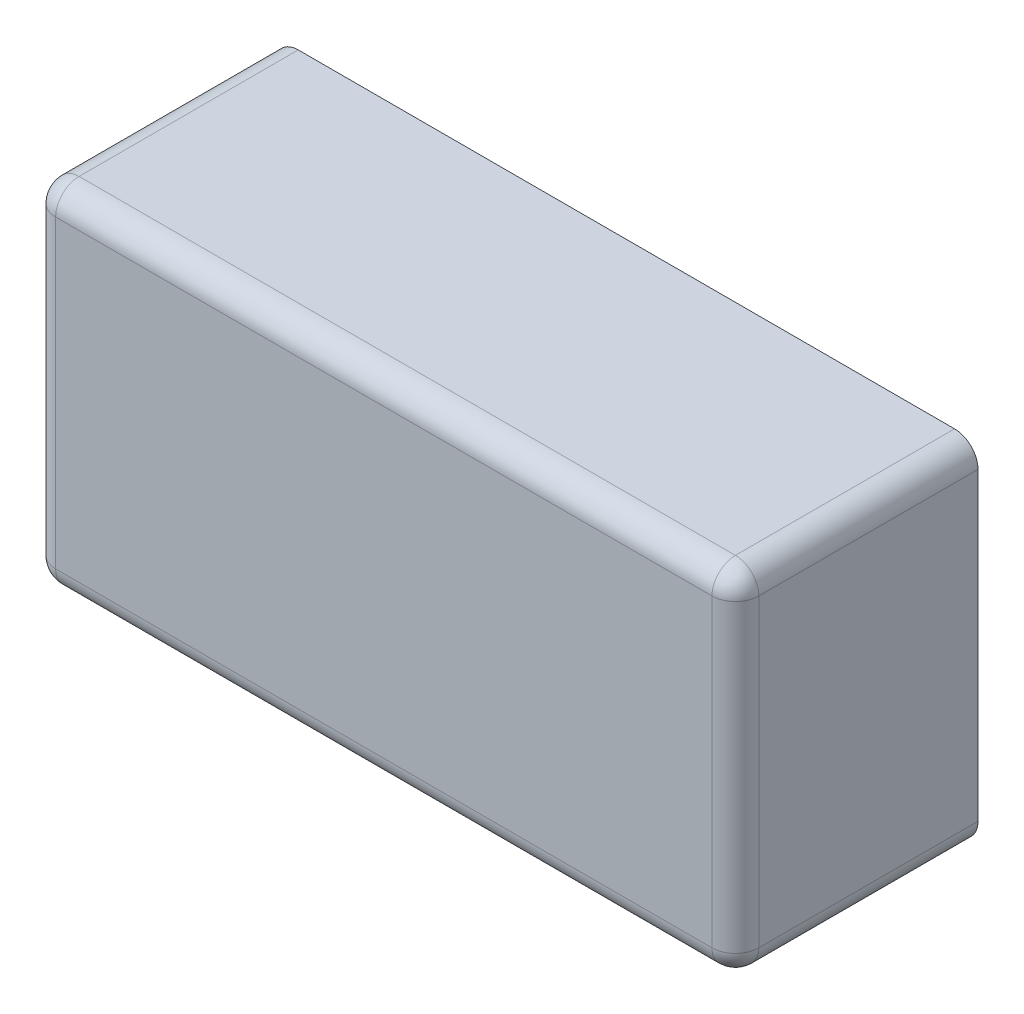
ISO-10303-21;
HEADER;
FILE_DESCRIPTION(('STEP AP214'),'2;1');
FILE_NAME('part.step','',(''),(''),'','','');
FILE_SCHEMA(('AUTOMOTIVE_DESIGN { 1 0 10303 214 1 1 1 1 }'));
ENDSEC;
DATA;
#1=APPLICATION_CONTEXT('core data for automotive mechanical design processes');
#2=APPLICATION_PROTOCOL_DEFINITION('international standard','automotive_design',2000,#1);
#3=PRODUCT_CONTEXT('',#1,'mechanical');
#4=PRODUCT('Part','Part','',(#3));
#5=PRODUCT_RELATED_PRODUCT_CATEGORY('part','',(#4));
#6=PRODUCT_DEFINITION_FORMATION('','',#4);
#7=PRODUCT_DEFINITION_CONTEXT('part definition',#1,'design');
#8=PRODUCT_DEFINITION('design','',#6,#7);
#9=PRODUCT_DEFINITION_SHAPE('','',#8);
#10=(LENGTH_UNIT() NAMED_UNIT(*) SI_UNIT(.MILLI.,.METRE.));
#11=(NAMED_UNIT(*) PLANE_ANGLE_UNIT() SI_UNIT($,.RADIAN.));
#12=(NAMED_UNIT(*) SI_UNIT($,.STERADIAN.) SOLID_ANGLE_UNIT());
#13=UNCERTAINTY_MEASURE_WITH_UNIT(LENGTH_MEASURE(1.E-05),#10,'distance_accuracy_value','');
#14=(GEOMETRIC_REPRESENTATION_CONTEXT(3) GLOBAL_UNCERTAINTY_ASSIGNED_CONTEXT((#13)) GLOBAL_UNIT_ASSIGNED_CONTEXT((#10,
#11,#12)) REPRESENTATION_CONTEXT('',''));
#15=CARTESIAN_POINT('',(0.,0.,0.));
#16=DIRECTION('',(0.,0.,1.));
#17=DIRECTION('',(1.,0.,0.));
#18=AXIS2_PLACEMENT_3D('',#15,#16,#17);
#19=CARTESIAN_POINT('',(0.28,-0.0749999999999999,0.205));
#20=DIRECTION('',(0.,1.,0.));
#21=DIRECTION('',(0.707106781186548,0.,0.707106781186548));
#22=AXIS2_PLACEMENT_3D('',#19,#20,#21);
#23=CYLINDRICAL_SURFACE('',#22,0.02);
#24=CARTESIAN_POINT('',(0.28,-0.13,0.205));
#25=DIRECTION('',(0.,1.,0.));
#26=DIRECTION('',(0.,0.,1.));
#27=AXIS2_PLACEMENT_3D('',#24,#25,#26);
#28=CIRCLE('',#27,0.02);
#29=CARTESIAN_POINT('',(0.28,-0.13,0.225));
#30=VERTEX_POINT('',#29);
#31=CARTESIAN_POINT('',(0.3,-0.13,0.205));
#32=VERTEX_POINT('',#31);
#33=EDGE_CURVE('E11',#30,#32,#28,.T.);
#34=ORIENTED_EDGE('',*,*,#33,.T.);
#35=DIRECTION('',(0.,1.,0.));
#36=VECTOR('',#35,1.);
#37=CARTESIAN_POINT('',(0.3,-0.0749999999999999,0.205));
#38=LINE('',#37,#36);
#39=CARTESIAN_POINT('',(0.3,0.13,0.205));
#40=VERTEX_POINT('',#39);
#41=EDGE_CURVE('E25',#32,#40,#38,.T.);
#42=ORIENTED_EDGE('',*,*,#41,.T.);
#43=CARTESIAN_POINT('',(0.28,0.13,0.205));
#44=DIRECTION('',(0.,-1.,0.));
#45=DIRECTION('',(1.,0.,0.));
#46=AXIS2_PLACEMENT_3D('',#43,#44,#45);
#47=CIRCLE('',#46,0.02);
#48=CARTESIAN_POINT('',(0.28,0.13,0.225));
#49=VERTEX_POINT('',#48);
#50=EDGE_CURVE('E273',#40,#49,#47,.T.);
#51=ORIENTED_EDGE('',*,*,#50,.T.);
#52=DIRECTION('',(0.,-1.,0.));
#53=VECTOR('',#52,1.);
#54=CARTESIAN_POINT('',(0.28,-0.0749999999999999,0.225));
#55=LINE('',#54,#53);
#56=EDGE_CURVE('E263',#49,#30,#55,.T.);
#57=ORIENTED_EDGE('',*,*,#56,.T.);
#58=EDGE_LOOP('',(#34,#42,#51,#57));
#59=FACE_BOUND('',#58,.T.);
#60=ADVANCED_FACE('F17',(#59),#23,.T.);
#61=CARTESIAN_POINT('',(-0.15,-0.13,0.205));
#62=DIRECTION('',(1.,0.,0.));
#63=DIRECTION('',(0.,-0.707106781186548,0.707106781186548));
#64=AXIS2_PLACEMENT_3D('',#61,#62,#63);
#65=CYLINDRICAL_SURFACE('',#64,0.02);
#66=CARTESIAN_POINT('',(-0.28,-0.13,0.205));
#67=DIRECTION('',(1.,0.,0.));
#68=DIRECTION('',(0.,0.,1.));
#69=AXIS2_PLACEMENT_3D('',#66,#67,#68);
#70=CIRCLE('',#69,0.02);
#71=CARTESIAN_POINT('',(-0.28,-0.13,0.225));
#72=VERTEX_POINT('',#71);
#73=CARTESIAN_POINT('',(-0.28,-0.15,0.205));
#74=VERTEX_POINT('',#73);
#75=EDGE_CURVE('E302',#72,#74,#70,.T.);
#76=ORIENTED_EDGE('',*,*,#75,.T.);
#77=DIRECTION('',(1.,0.,0.));
#78=VECTOR('',#77,1.);
#79=CARTESIAN_POINT('',(-0.15,-0.15,0.205));
#80=LINE('',#79,#78);
#81=CARTESIAN_POINT('',(0.28,-0.15,0.205));
#82=VERTEX_POINT('',#81);
#83=EDGE_CURVE('E304',#74,#82,#80,.T.);
#84=ORIENTED_EDGE('',*,*,#83,.T.);
#85=CARTESIAN_POINT('',(0.28,-0.13,0.205));
#86=DIRECTION('',(-1.,0.,0.));
#87=DIRECTION('',(0.,-1.,0.));
#88=AXIS2_PLACEMENT_3D('',#85,#86,#87);
#89=CIRCLE('',#88,0.02);
#90=EDGE_CURVE('E308',#82,#30,#89,.T.);
#91=ORIENTED_EDGE('',*,*,#90,.T.);
#92=DIRECTION('',(-1.,0.,0.));
#93=VECTOR('',#92,1.);
#94=CARTESIAN_POINT('',(-0.15,-0.13,0.225));
#95=LINE('',#94,#93);
#96=EDGE_CURVE('E315',#30,#72,#95,.T.);
#97=ORIENTED_EDGE('',*,*,#96,.T.);
#98=EDGE_LOOP('',(#76,#84,#91,#97));
#99=FACE_BOUND('',#98,.T.);
#100=ADVANCED_FACE('F347',(#99),#65,.T.);
#101=CARTESIAN_POINT('',(0.28,-0.13,0.205));
#102=DIRECTION('',(0.408248290463864,-0.408248290463861,-0.816496580927726));
#103=DIRECTION('',(0.577350269189627,-0.577350269189626,0.577350269189625));
#104=AXIS2_PLACEMENT_3D('',#101,#102,#103);
#105=SPHERICAL_SURFACE('',#104,0.02);
#106=ORIENTED_EDGE('',*,*,#90,.F.);
#107=CARTESIAN_POINT('',(0.28,-0.13,0.205));
#108=DIRECTION('',(0.,0.,1.));
#109=DIRECTION('',(0.707106781186548,-0.707106781186547,0.));
#110=AXIS2_PLACEMENT_3D('',#107,#108,#109);
#111=CIRCLE('',#110,0.02);
#112=EDGE_CURVE('E116',#82,#32,#111,.T.);
#113=ORIENTED_EDGE('',*,*,#112,.T.);
#114=ORIENTED_EDGE('',*,*,#33,.F.);
#115=EDGE_LOOP('',(#106,#113,#114));
#116=FACE_BOUND('',#115,.T.);
#117=ADVANCED_FACE('F214',(#116),#105,.T.);
#118=CARTESIAN_POINT('',(-0.28,0.0749999999999999,0.205));
#119=DIRECTION('',(0.,-1.,0.));
#120=DIRECTION('',(-0.707106781186548,0.,0.707106781186548));
#121=AXIS2_PLACEMENT_3D('',#118,#119,#120);
#122=CYLINDRICAL_SURFACE('',#121,0.02);
#123=CARTESIAN_POINT('',(-0.28,0.13,0.205));
#124=DIRECTION('',(0.,-1.,0.));
#125=DIRECTION('',(0.,0.,1.));
#126=AXIS2_PLACEMENT_3D('',#123,#124,#125);
#127=CIRCLE('',#126,0.02);
#128=CARTESIAN_POINT('',(-0.28,0.13,0.225));
#129=VERTEX_POINT('',#128);
#130=CARTESIAN_POINT('',(-0.3,0.13,0.205));
#131=VERTEX_POINT('',#130);
#132=EDGE_CURVE('E238',#129,#131,#127,.T.);
#133=ORIENTED_EDGE('',*,*,#132,.T.);
#134=DIRECTION('',(0.,-1.,0.));
#135=VECTOR('',#134,1.);
#136=CARTESIAN_POINT('',(-0.3,0.0749999999999999,0.205));
#137=LINE('',#136,#135);
#138=CARTESIAN_POINT('',(-0.3,-0.13,0.205));
#139=VERTEX_POINT('',#138);
#140=EDGE_CURVE('E236',#131,#139,#137,.T.);
#141=ORIENTED_EDGE('',*,*,#140,.T.);
#142=CARTESIAN_POINT('',(-0.28,-0.13,0.205));
#143=DIRECTION('',(0.,1.,0.));
#144=DIRECTION('',(-1.,0.,0.));
#145=AXIS2_PLACEMENT_3D('',#142,#143,#144);
#146=CIRCLE('',#145,0.02);
#147=EDGE_CURVE('E190',#139,#72,#146,.T.);
#148=ORIENTED_EDGE('',*,*,#147,.T.);
#149=DIRECTION('',(0.,1.,0.));
#150=VECTOR('',#149,1.);
#151=CARTESIAN_POINT('',(-0.28,0.0749999999999999,0.225));
#152=LINE('',#151,#150);
#153=EDGE_CURVE('E185',#72,#129,#152,.T.);
#154=ORIENTED_EDGE('',*,*,#153,.T.);
#155=EDGE_LOOP('',(#133,#141,#148,#154));
#156=FACE_BOUND('',#155,.T.);
#157=ADVANCED_FACE('F208',(#156),#122,.T.);
#158=CARTESIAN_POINT('',(-0.28,-0.13,0.205));
#159=DIRECTION('',(-0.408248290463864,-0.408248290463862,-0.816496580927726));
#160=DIRECTION('',(-0.577350269189626,-0.577350269189625,0.577350269189626));
#161=AXIS2_PLACEMENT_3D('',#158,#159,#160);
#162=SPHERICAL_SURFACE('',#161,0.02);
#163=ORIENTED_EDGE('',*,*,#147,.F.);
#164=CARTESIAN_POINT('',(-0.28,-0.13,0.205));
#165=DIRECTION('',(0.,0.,1.));
#166=DIRECTION('',(-0.707106781186548,-0.707106781186547,0.));
#167=AXIS2_PLACEMENT_3D('',#164,#165,#166);
#168=CIRCLE('',#167,0.02);
#169=EDGE_CURVE('E180',#139,#74,#168,.T.);
#170=ORIENTED_EDGE('',*,*,#169,.T.);
#171=ORIENTED_EDGE('',*,*,#75,.F.);
#172=EDGE_LOOP('',(#163,#170,#171));
#173=FACE_BOUND('',#172,.T.);
#174=ADVANCED_FACE('F197',(#173),#162,.T.);
#175=CARTESIAN_POINT('',(0.15,0.13,0.205));
#176=DIRECTION('',(-1.,0.,0.));
#177=DIRECTION('',(0.,0.707106781186547,0.707106781186548));
#178=AXIS2_PLACEMENT_3D('',#175,#176,#177);
#179=CYLINDRICAL_SURFACE('',#178,0.02);
#180=CARTESIAN_POINT('',(0.28,0.13,0.205));
#181=DIRECTION('',(-1.,0.,0.));
#182=DIRECTION('',(0.,0.,1.));
#183=AXIS2_PLACEMENT_3D('',#180,#181,#182);
#184=CIRCLE('',#183,0.02);
#185=CARTESIAN_POINT('',(0.28,0.15,0.205));
#186=VERTEX_POINT('',#185);
#187=EDGE_CURVE('E176',#49,#186,#184,.T.);
#188=ORIENTED_EDGE('',*,*,#187,.T.);
#189=DIRECTION('',(-1.,0.,0.));
#190=VECTOR('',#189,1.);
#191=CARTESIAN_POINT('',(0.15,0.15,0.205));
#192=LINE('',#191,#190);
#193=CARTESIAN_POINT('',(-0.28,0.15,0.205));
#194=VERTEX_POINT('',#193);
#195=EDGE_CURVE('E174',#186,#194,#192,.T.);
#196=ORIENTED_EDGE('',*,*,#195,.T.);
#197=CARTESIAN_POINT('',(-0.28,0.13,0.205));
#198=DIRECTION('',(1.,0.,0.));
#199=DIRECTION('',(0.,1.,0.));
#200=AXIS2_PLACEMENT_3D('',#197,#198,#199);
#201=CIRCLE('',#200,0.02);
#202=EDGE_CURVE('E169',#194,#129,#201,.T.);
#203=ORIENTED_EDGE('',*,*,#202,.T.);
#204=DIRECTION('',(1.,0.,0.));
#205=VECTOR('',#204,1.);
#206=CARTESIAN_POINT('',(0.15,0.13,0.225));
#207=LINE('',#206,#205);
#208=EDGE_CURVE('E164',#129,#49,#207,.T.);
#209=ORIENTED_EDGE('',*,*,#208,.T.);
#210=EDGE_LOOP('',(#188,#196,#203,#209));
#211=FACE_BOUND('',#210,.T.);
#212=ADVANCED_FACE('F207',(#211),#179,.T.);
#213=CARTESIAN_POINT('',(-0.28,0.13,0.205));
#214=DIRECTION('',(-0.816496580927726,-0.408248290463864,-0.408248290463863));
#215=DIRECTION('',(-0.577350269189626,0.577350269189627,0.577350269189625));
#216=AXIS2_PLACEMENT_3D('',#213,#214,#215);
#217=SPHERICAL_SURFACE('',#216,0.02);
#218=ORIENTED_EDGE('',*,*,#202,.F.);
#219=CARTESIAN_POINT('',(-0.28,0.13,0.205));
#220=DIRECTION('',(0.,0.,1.));
#221=DIRECTION('',(-0.707106781186548,0.707106781186547,0.));
#222=AXIS2_PLACEMENT_3D('',#219,#220,#221);
#223=CIRCLE('',#222,0.02);
#224=EDGE_CURVE('E159',#194,#131,#223,.T.);
#225=ORIENTED_EDGE('',*,*,#224,.T.);
#226=ORIENTED_EDGE('',*,*,#132,.F.);
#227=EDGE_LOOP('',(#218,#225,#226));
#228=FACE_BOUND('',#227,.T.);
#229=ADVANCED_FACE('F241',(#228),#217,.T.);
#230=CARTESIAN_POINT('',(0.28,0.13,0.205));
#231=DIRECTION('',(0.408248290463864,0.408248290463862,-0.816496580927726));
#232=DIRECTION('',(0.577350269189626,0.577350269189625,0.577350269189626));
#233=AXIS2_PLACEMENT_3D('',#230,#231,#232);
#234=SPHERICAL_SURFACE('',#233,0.02);
#235=ORIENTED_EDGE('',*,*,#50,.F.);
#236=CARTESIAN_POINT('',(0.28,0.13,0.205));
#237=DIRECTION('',(0.,0.,1.));
#238=DIRECTION('',(0.707106781186548,0.707106781186547,0.));
#239=AXIS2_PLACEMENT_3D('',#236,#237,#238);
#240=CIRCLE('',#239,0.02);
#241=EDGE_CURVE('E154',#40,#186,#240,.T.);
#242=ORIENTED_EDGE('',*,*,#241,.T.);
#243=ORIENTED_EDGE('',*,*,#187,.F.);
#244=EDGE_LOOP('',(#235,#242,#243));
#245=FACE_BOUND('',#244,.T.);
#246=ADVANCED_FACE('F250',(#245),#234,.T.);
#247=CARTESIAN_POINT('',(-0.28,-0.13,0.));
#248=DIRECTION('',(0.,0.,1.));
#249=DIRECTION('',(-0.707106781186548,-0.707106781186547,0.));
#250=AXIS2_PLACEMENT_3D('',#247,#248,#249);
#251=CYLINDRICAL_SURFACE('',#250,0.02);
#252=ORIENTED_EDGE('',*,*,#169,.F.);
#253=DIRECTION('',(0.,0.,-1.));
#254=VECTOR('',#253,1.);
#255=CARTESIAN_POINT('',(-0.3,-0.13,0.));
#256=LINE('',#255,#254);
#257=CARTESIAN_POINT('',(-0.3,-0.13,0.0180000000000001));
#258=VERTEX_POINT('',#257);
#259=EDGE_CURVE('E150',#139,#258,#256,.T.);
#260=ORIENTED_EDGE('',*,*,#259,.T.);
#261=CARTESIAN_POINT('',(-0.28,-0.13,0.0180000000000001));
#262=DIRECTION('',(0.,0.,1.));
#263=DIRECTION('',(-0.707106781186548,-0.707106781186547,0.));
#264=AXIS2_PLACEMENT_3D('',#261,#262,#263);
#265=CIRCLE('',#264,0.02);
#266=CARTESIAN_POINT('',(-0.28,-0.15,0.018));
#267=VERTEX_POINT('',#266);
#268=EDGE_CURVE('E148',#258,#267,#265,.T.);
#269=ORIENTED_EDGE('',*,*,#268,.T.);
#270=DIRECTION('',(0.,0.,1.));
#271=VECTOR('',#270,1.);
#272=CARTESIAN_POINT('',(-0.28,-0.15,0.));
#273=LINE('',#272,#271);
#274=EDGE_CURVE('E112',#267,#74,#273,.T.);
#275=ORIENTED_EDGE('',*,*,#274,.T.);
#276=EDGE_LOOP('',(#252,#260,#269,#275));
#277=FACE_BOUND('',#276,.T.);
#278=ADVANCED_FACE('F255',(#277),#251,.T.);
#279=CARTESIAN_POINT('',(-0.3,0.15,0.));
#280=DIRECTION('',(-1.,0.,0.));
#281=DIRECTION('',(0.,-1.,0.));
#282=AXIS2_PLACEMENT_3D('',#279,#280,#281);
#283=PLANE('',#282);
#284=ORIENTED_EDGE('',*,*,#140,.F.);
#285=DIRECTION('',(0.,0.,1.));
#286=VECTOR('',#285,1.);
#287=CARTESIAN_POINT('',(-0.3,0.13,0.));
#288=LINE('',#287,#286);
#289=CARTESIAN_POINT('',(-0.3,0.13,0.0180000000000001));
#290=VERTEX_POINT('',#289);
#291=EDGE_CURVE('E142',#290,#131,#288,.T.);
#292=ORIENTED_EDGE('',*,*,#291,.F.);
#293=DIRECTION('',(0.,-1.,0.));
#294=VECTOR('',#293,1.);
#295=CARTESIAN_POINT('',(-0.3,0.15,0.0180000000000001));
#296=LINE('',#295,#294);
#297=EDGE_CURVE('E139',#290,#258,#296,.T.);
#298=ORIENTED_EDGE('',*,*,#297,.T.);
#299=ORIENTED_EDGE('',*,*,#259,.F.);
#300=EDGE_LOOP('',(#284,#292,#298,#299));
#301=FACE_BOUND('',#300,.T.);
#302=ADVANCED_FACE('F327',(#301),#283,.T.);
#303=CARTESIAN_POINT('',(-0.28,0.13,0.));
#304=DIRECTION('',(0.,0.,1.));
#305=DIRECTION('',(-0.707106781186548,0.707106781186547,0.));
#306=AXIS2_PLACEMENT_3D('',#303,#304,#305);
#307=CYLINDRICAL_SURFACE('',#306,0.02);
#308=ORIENTED_EDGE('',*,*,#224,.F.);
#309=DIRECTION('',(0.,0.,-1.));
#310=VECTOR('',#309,1.);
#311=CARTESIAN_POINT('',(-0.28,0.15,0.));
#312=LINE('',#311,#310);
#313=CARTESIAN_POINT('',(-0.28,0.15,0.018));
#314=VERTEX_POINT('',#313);
#315=EDGE_CURVE('E137',#194,#314,#312,.T.);
#316=ORIENTED_EDGE('',*,*,#315,.T.);
#317=CARTESIAN_POINT('',(-0.28,0.13,0.0180000000000001));
#318=DIRECTION('',(0.,0.,1.));
#319=DIRECTION('',(-0.707106781186548,0.707106781186547,0.));
#320=AXIS2_PLACEMENT_3D('',#317,#318,#319);
#321=CIRCLE('',#320,0.02);
#322=EDGE_CURVE('E134',#314,#290,#321,.T.);
#323=ORIENTED_EDGE('',*,*,#322,.T.);
#324=ORIENTED_EDGE('',*,*,#291,.T.);
#325=EDGE_LOOP('',(#308,#316,#323,#324));
#326=FACE_BOUND('',#325,.T.);
#327=ADVANCED_FACE('F332',(#326),#307,.T.);
#328=CARTESIAN_POINT('',(0.3,0.15,0.));
#329=DIRECTION('',(0.,1.,0.));
#330=DIRECTION('',(-1.,0.,0.));
#331=AXIS2_PLACEMENT_3D('',#328,#329,#330);
#332=PLANE('',#331);
#333=ORIENTED_EDGE('',*,*,#195,.F.);
#334=DIRECTION('',(0.,0.,1.));
#335=VECTOR('',#334,1.);
#336=CARTESIAN_POINT('',(0.28,0.15,0.));
#337=LINE('',#336,#335);
#338=CARTESIAN_POINT('',(0.28,0.15,0.0179999999999999));
#339=VERTEX_POINT('',#338);
#340=EDGE_CURVE('E131',#339,#186,#337,.T.);
#341=ORIENTED_EDGE('',*,*,#340,.F.);
#342=DIRECTION('',(-1.,0.,0.));
#343=VECTOR('',#342,1.);
#344=CARTESIAN_POINT('',(-0.0256363753000003,0.15,0.018));
#345=LINE('',#344,#343);
#346=EDGE_CURVE('E128',#339,#314,#345,.T.);
#347=ORIENTED_EDGE('',*,*,#346,.T.);
#348=ORIENTED_EDGE('',*,*,#315,.F.);
#349=EDGE_LOOP('',(#333,#341,#347,#348));
#350=FACE_BOUND('',#349,.T.);
#351=ADVANCED_FACE('F336',(#350),#332,.T.);
#352=CARTESIAN_POINT('',(0.,0.,0.225));
#353=DIRECTION('',(0.,0.,1.));
#354=DIRECTION('',(1.,0.,0.));
#355=AXIS2_PLACEMENT_3D('',#352,#353,#354);
#356=PLANE('',#355);
#357=ORIENTED_EDGE('',*,*,#56,.F.);
#358=ORIENTED_EDGE('',*,*,#208,.F.);
#359=ORIENTED_EDGE('',*,*,#153,.F.);
#360=ORIENTED_EDGE('',*,*,#96,.F.);
#361=EDGE_LOOP('',(#357,#358,#359,#360));
#362=FACE_BOUND('',#361,.T.);
#363=ADVANCED_FACE('F349',(#362),#356,.T.);
#364=CARTESIAN_POINT('',(-0.3512727506,0.15,0.0180000000000001));
#365=DIRECTION('',(0.,0.,1.));
#366=DIRECTION('',(1.,0.,0.));
#367=AXIS2_PLACEMENT_3D('',#364,#365,#366);
#368=PLANE('',#367);
#369=ORIENTED_EDGE('',*,*,#322,.F.);
#370=ORIENTED_EDGE('',*,*,#346,.F.);
#371=CARTESIAN_POINT('',(0.28,0.13,0.0180000000000001));
#372=DIRECTION('',(0.,0.,1.));
#373=DIRECTION('',(0.707106781186548,0.707106781186547,0.));
#374=AXIS2_PLACEMENT_3D('',#371,#372,#373);
#375=CIRCLE('',#374,0.02);
#376=CARTESIAN_POINT('',(0.3,0.13,0.0179999999999999));
#377=VERTEX_POINT('',#376);
#378=EDGE_CURVE('E125',#377,#339,#375,.T.);
#379=ORIENTED_EDGE('',*,*,#378,.F.);
#380=DIRECTION('',(0.,1.,0.));
#381=VECTOR('',#380,1.);
#382=CARTESIAN_POINT('',(0.3,0.,0.0179999999999999));
#383=LINE('',#382,#381);
#384=CARTESIAN_POINT('',(0.3,-0.13,0.0179999999999999));
#385=VERTEX_POINT('',#384);
#386=EDGE_CURVE('E99',#385,#377,#383,.T.);
#387=ORIENTED_EDGE('',*,*,#386,.F.);
#388=CARTESIAN_POINT('',(0.28,-0.13,0.0180000000000001));
#389=DIRECTION('',(0.,0.,1.));
#390=DIRECTION('',(0.707106781186548,-0.707106781186547,0.));
#391=AXIS2_PLACEMENT_3D('',#388,#389,#390);
#392=CIRCLE('',#391,0.02);
#393=CARTESIAN_POINT('',(0.28,-0.15,0.0179999999999999));
#394=VERTEX_POINT('',#393);
#395=EDGE_CURVE('E92',#394,#385,#392,.T.);
#396=ORIENTED_EDGE('',*,*,#395,.F.);
#397=DIRECTION('',(1.,0.,0.));
#398=VECTOR('',#397,1.);
#399=CARTESIAN_POINT('',(-0.3256363753,-0.15,0.0180000000000001));
#400=LINE('',#399,#398);
#401=EDGE_CURVE('E97',#267,#394,#400,.T.);
#402=ORIENTED_EDGE('',*,*,#401,.F.);
#403=ORIENTED_EDGE('',*,*,#268,.F.);
#404=ORIENTED_EDGE('',*,*,#297,.F.);
#405=EDGE_LOOP('',(#369,#370,#379,#387,#396,#402,#403,#404));
#406=FACE_BOUND('',#405,.T.);
#407=ADVANCED_FACE('F95',(#406),#368,.F.);
#408=CARTESIAN_POINT('',(-0.3,-0.15,0.));
#409=DIRECTION('',(0.,-1.,0.));
#410=DIRECTION('',(1.,0.,0.));
#411=AXIS2_PLACEMENT_3D('',#408,#409,#410);
#412=PLANE('',#411);
#413=ORIENTED_EDGE('',*,*,#83,.F.);
#414=ORIENTED_EDGE('',*,*,#274,.F.);
#415=ORIENTED_EDGE('',*,*,#401,.T.);
#416=DIRECTION('',(0.,0.,-1.));
#417=VECTOR('',#416,1.);
#418=CARTESIAN_POINT('',(0.28,-0.15,0.));
#419=LINE('',#418,#417);
#420=EDGE_CURVE('E110',#82,#394,#419,.T.);
#421=ORIENTED_EDGE('',*,*,#420,.F.);
#422=EDGE_LOOP('',(#413,#414,#415,#421));
#423=FACE_BOUND('',#422,.T.);
#424=ADVANCED_FACE('F109',(#423),#412,.T.);
#425=CARTESIAN_POINT('',(0.28,0.13,0.));
#426=DIRECTION('',(0.,0.,1.));
#427=DIRECTION('',(0.707106781186548,0.707106781186547,0.));
#428=AXIS2_PLACEMENT_3D('',#425,#426,#427);
#429=CYLINDRICAL_SURFACE('',#428,0.02);
#430=ORIENTED_EDGE('',*,*,#241,.F.);
#431=DIRECTION('',(0.,0.,-1.));
#432=VECTOR('',#431,1.);
#433=CARTESIAN_POINT('',(0.3,0.13,0.));
#434=LINE('',#433,#432);
#435=EDGE_CURVE('E117',#40,#377,#434,.T.);
#436=ORIENTED_EDGE('',*,*,#435,.T.);
#437=ORIENTED_EDGE('',*,*,#378,.T.);
#438=ORIENTED_EDGE('',*,*,#340,.T.);
#439=EDGE_LOOP('',(#430,#436,#437,#438));
#440=FACE_BOUND('',#439,.T.);
#441=ADVANCED_FACE('F338',(#440),#429,.T.);
#442=CARTESIAN_POINT('',(0.3,-0.15,0.));
#443=DIRECTION('',(1.,0.,0.));
#444=DIRECTION('',(0.,1.,0.));
#445=AXIS2_PLACEMENT_3D('',#442,#443,#444);
#446=PLANE('',#445);
#447=ORIENTED_EDGE('',*,*,#41,.F.);
#448=DIRECTION('',(0.,0.,1.));
#449=VECTOR('',#448,1.);
#450=CARTESIAN_POINT('',(0.3,-0.13,0.));
#451=LINE('',#450,#449);
#452=EDGE_CURVE('E120',#385,#32,#451,.T.);
#453=ORIENTED_EDGE('',*,*,#452,.F.);
#454=ORIENTED_EDGE('',*,*,#386,.T.);
#455=ORIENTED_EDGE('',*,*,#435,.F.);
#456=EDGE_LOOP('',(#447,#453,#454,#455));
#457=FACE_BOUND('',#456,.T.);
#458=ADVANCED_FACE('F341',(#457),#446,.T.);
#459=CARTESIAN_POINT('',(0.28,-0.13,0.));
#460=DIRECTION('',(0.,0.,1.));
#461=DIRECTION('',(0.707106781186548,-0.707106781186547,0.));
#462=AXIS2_PLACEMENT_3D('',#459,#460,#461);
#463=CYLINDRICAL_SURFACE('',#462,0.02);
#464=ORIENTED_EDGE('',*,*,#112,.F.);
#465=ORIENTED_EDGE('',*,*,#420,.T.);
#466=ORIENTED_EDGE('',*,*,#395,.T.);
#467=ORIENTED_EDGE('',*,*,#452,.T.);
#468=EDGE_LOOP('',(#464,#465,#466,#467));
#469=FACE_BOUND('',#468,.T.);
#470=ADVANCED_FACE('F115',(#469),#463,.T.);
#471=CLOSED_SHELL('',(#60,#100,#117,#157,#174,#212,#229,#246,#278,#302,#327,#351,#363,#407,#424,
#441,#458,#470));
#472=MANIFOLD_SOLID_BREP('B1',#471);
#473=ADVANCED_BREP_SHAPE_REPRESENTATION('',(#18,#472),#14);
#474=SHAPE_DEFINITION_REPRESENTATION(#9,#473);
ENDSEC;
END-ISO-10303-21;
